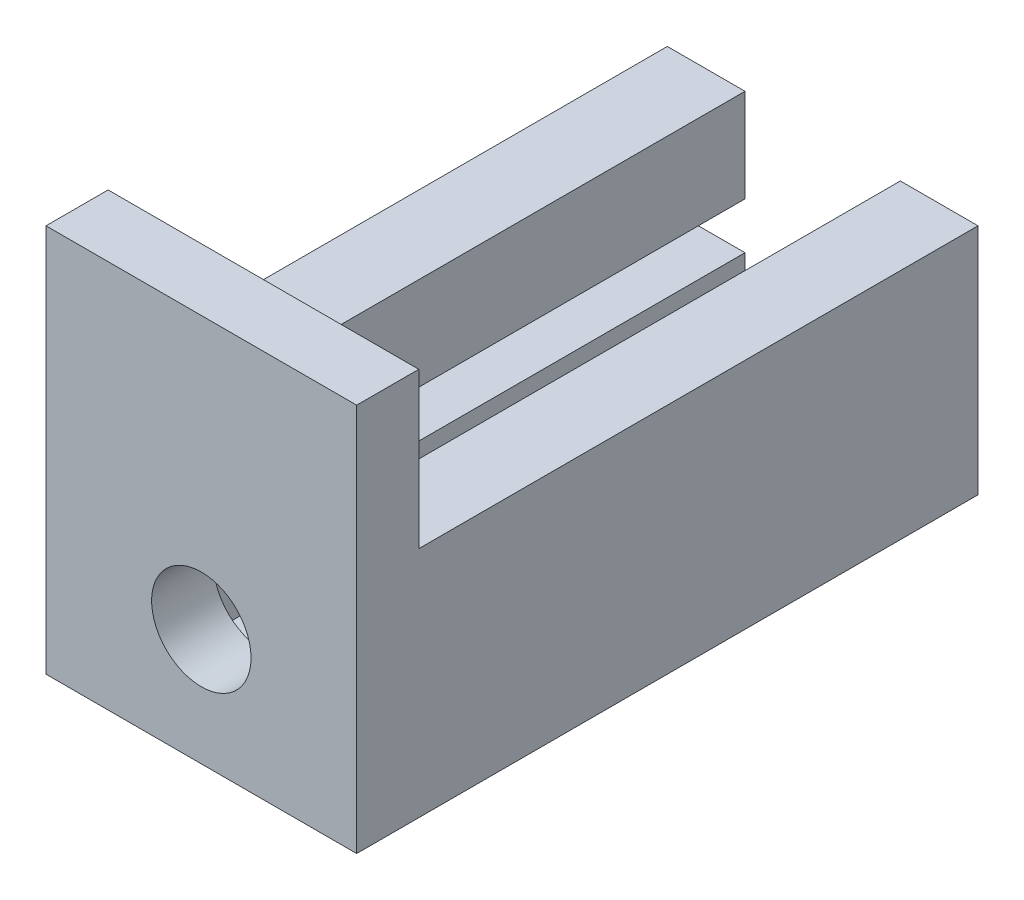
ISO-10303-21;
HEADER;
FILE_DESCRIPTION(('STEP AP214'),'2;1');
FILE_NAME('part.step','',(''),(''),'','','');
FILE_SCHEMA(('AUTOMOTIVE_DESIGN { 1 0 10303 214 1 1 1 1 }'));
ENDSEC;
DATA;
#1=APPLICATION_CONTEXT('core data for automotive mechanical design processes');
#2=APPLICATION_PROTOCOL_DEFINITION('international standard','automotive_design',2000,#1);
#3=PRODUCT_CONTEXT('',#1,'mechanical');
#4=PRODUCT('Part','Part','',(#3));
#5=PRODUCT_RELATED_PRODUCT_CATEGORY('part','',(#4));
#6=PRODUCT_DEFINITION_FORMATION('','',#4);
#7=PRODUCT_DEFINITION_CONTEXT('part definition',#1,'design');
#8=PRODUCT_DEFINITION('design','',#6,#7);
#9=PRODUCT_DEFINITION_SHAPE('','',#8);
#10=(LENGTH_UNIT() NAMED_UNIT(*) SI_UNIT(.MILLI.,.METRE.));
#11=(NAMED_UNIT(*) PLANE_ANGLE_UNIT() SI_UNIT($,.RADIAN.));
#12=(NAMED_UNIT(*) SI_UNIT($,.STERADIAN.) SOLID_ANGLE_UNIT());
#13=UNCERTAINTY_MEASURE_WITH_UNIT(LENGTH_MEASURE(1.E-05),#10,'distance_accuracy_value','');
#14=(GEOMETRIC_REPRESENTATION_CONTEXT(3) GLOBAL_UNCERTAINTY_ASSIGNED_CONTEXT((#13)) GLOBAL_UNIT_ASSIGNED_CONTEXT((#10,
#11,#12)) REPRESENTATION_CONTEXT('',''));
#15=CARTESIAN_POINT('',(0.,0.,0.));
#16=DIRECTION('',(0.,0.,1.));
#17=DIRECTION('',(1.,0.,0.));
#18=AXIS2_PLACEMENT_3D('',#15,#16,#17);
#19=CARTESIAN_POINT('',(-5.,15.,36.));
#20=DIRECTION('',(0.,-1.,0.));
#21=DIRECTION('',(1.,0.,0.));
#22=AXIS2_PLACEMENT_3D('',#19,#20,#21);
#23=PLANE('',#22);
#24=DIRECTION('',(-1.,0.,0.));
#25=VECTOR('',#24,1.);
#26=CARTESIAN_POINT('',(-5.,15.,36.));
#27=LINE('',#26,#25);
#28=CARTESIAN_POINT('',(15.,14.9999999999999,36.));
#29=VERTEX_POINT('',#28);
#30=CARTESIAN_POINT('',(10.,14.9999999999999,36.));
#31=VERTEX_POINT('',#30);
#32=EDGE_CURVE('E47',#29,#31,#27,.T.);
#33=ORIENTED_EDGE('',*,*,#32,.F.);
#34=DIRECTION('',(0.,0.,-1.));
#35=VECTOR('',#34,1.);
#36=CARTESIAN_POINT('',(15.,14.9999999999999,36.));
#37=LINE('',#36,#35);
#38=CARTESIAN_POINT('',(15.,14.9999999999999,0.));
#39=VERTEX_POINT('',#38);
#40=EDGE_CURVE('E248',#29,#39,#37,.T.);
#41=ORIENTED_EDGE('',*,*,#40,.T.);
#42=DIRECTION('',(-1.,0.,0.));
#43=VECTOR('',#42,1.);
#44=CARTESIAN_POINT('',(15.,14.9999999999999,0.));
#45=LINE('',#44,#43);
#46=CARTESIAN_POINT('',(10.,14.9999999999999,0.));
#47=VERTEX_POINT('',#46);
#48=EDGE_CURVE('E190',#39,#47,#45,.T.);
#49=ORIENTED_EDGE('',*,*,#48,.T.);
#50=DIRECTION('',(0.,0.,-1.));
#51=VECTOR('',#50,1.);
#52=CARTESIAN_POINT('',(10.,14.9999999999999,36.));
#53=LINE('',#52,#51);
#54=EDGE_CURVE('E123',#31,#47,#53,.T.);
#55=ORIENTED_EDGE('',*,*,#54,.F.);
#56=EDGE_LOOP('',(#33,#41,#49,#55));
#57=FACE_BOUND('',#56,.T.);
#58=ADVANCED_FACE('F37',(#57),#23,.F.);
#59=CARTESIAN_POINT('',(0.,15.,36.));
#60=VERTEX_POINT('',#59);
#61=CARTESIAN_POINT('',(-5.,15.,36.));
#62=VERTEX_POINT('',#61);
#63=EDGE_CURVE('E11',#60,#62,#27,.T.);
#64=ORIENTED_EDGE('',*,*,#63,.F.);
#65=DIRECTION('',(0.,0.,-1.));
#66=VECTOR('',#65,1.);
#67=CARTESIAN_POINT('',(0.,14.9999999999999,36.));
#68=LINE('',#67,#66);
#69=CARTESIAN_POINT('',(0.,14.9999999999999,0.));
#70=VERTEX_POINT('',#69);
#71=EDGE_CURVE('E224',#60,#70,#68,.T.);
#72=ORIENTED_EDGE('',*,*,#71,.T.);
#73=DIRECTION('',(-1.,0.,0.));
#74=VECTOR('',#73,1.);
#75=CARTESIAN_POINT('',(-5.,15.,0.));
#76=LINE('',#75,#74);
#77=CARTESIAN_POINT('',(-5.,15.,0.));
#78=VERTEX_POINT('',#77);
#79=EDGE_CURVE('E214',#70,#78,#76,.T.);
#80=ORIENTED_EDGE('',*,*,#79,.T.);
#81=DIRECTION('',(0.,0.,-1.));
#82=VECTOR('',#81,1.);
#83=CARTESIAN_POINT('',(-5.,15.,36.));
#84=LINE('',#83,#82);
#85=EDGE_CURVE('E222',#62,#78,#84,.T.);
#86=ORIENTED_EDGE('',*,*,#85,.F.);
#87=EDGE_LOOP('',(#64,#72,#80,#86));
#88=FACE_BOUND('',#87,.T.);
#89=ADVANCED_FACE('F329',(#88),#23,.F.);
#90=CARTESIAN_POINT('',(15.,0.,36.));
#91=DIRECTION('',(-1.,0.,0.));
#92=DIRECTION('',(0.,0.,1.));
#93=AXIS2_PLACEMENT_3D('',#90,#91,#92);
#94=PLANE('',#93);
#95=DIRECTION('',(0.,1.,0.));
#96=VECTOR('',#95,1.);
#97=CARTESIAN_POINT('',(15.,0.,0.));
#98=LINE('',#97,#96);
#99=CARTESIAN_POINT('',(15.,0.,0.));
#100=VERTEX_POINT('',#99);
#101=EDGE_CURVE('E187',#100,#39,#98,.T.);
#102=ORIENTED_EDGE('',*,*,#101,.T.);
#103=ORIENTED_EDGE('',*,*,#40,.F.);
#104=DIRECTION('',(0.,-1.,0.));
#105=VECTOR('',#104,1.);
#106=CARTESIAN_POINT('',(15.0000000000001,24.9999999999998,36.));
#107=LINE('',#106,#105);
#108=CARTESIAN_POINT('',(15.0000000000001,24.9999999999998,36.));
#109=VERTEX_POINT('',#108);
#110=EDGE_CURVE('E276',#109,#29,#107,.T.);
#111=ORIENTED_EDGE('',*,*,#110,.F.);
#112=DIRECTION('',(0.,0.,-1.));
#113=VECTOR('',#112,1.);
#114=CARTESIAN_POINT('',(15.0000000000001,24.9999999999998,36.));
#115=LINE('',#114,#113);
#116=CARTESIAN_POINT('',(15.0000000000001,24.9999999999998,40.));
#117=VERTEX_POINT('',#116);
#118=EDGE_CURVE('E352',#117,#109,#115,.T.);
#119=ORIENTED_EDGE('',*,*,#118,.F.);
#120=DIRECTION('',(0.,1.,0.));
#121=VECTOR('',#120,1.);
#122=CARTESIAN_POINT('',(15.,15.,40.));
#123=LINE('',#122,#121);
#124=CARTESIAN_POINT('',(15.,0.,40.));
#125=VERTEX_POINT('',#124);
#126=EDGE_CURVE('E191',#125,#117,#123,.T.);
#127=ORIENTED_EDGE('',*,*,#126,.F.);
#128=DIRECTION('',(0.,0.,-1.));
#129=VECTOR('',#128,1.);
#130=CARTESIAN_POINT('',(15.,0.,36.));
#131=LINE('',#130,#129);
#132=EDGE_CURVE('E41',#125,#100,#131,.T.);
#133=ORIENTED_EDGE('',*,*,#132,.T.);
#134=EDGE_LOOP('',(#102,#103,#111,#119,#127,#133));
#135=FACE_BOUND('',#134,.T.);
#136=ADVANCED_FACE('F39',(#135),#94,.F.);
#137=CARTESIAN_POINT('',(10.,14.9999999999999,36.));
#138=DIRECTION('',(1.,0.,0.));
#139=DIRECTION('',(0.,0.,-1.));
#140=AXIS2_PLACEMENT_3D('',#137,#138,#139);
#141=PLANE('',#140);
#142=DIRECTION('',(0.,-1.,0.));
#143=VECTOR('',#142,1.);
#144=CARTESIAN_POINT('',(10.,14.9999999999999,0.));
#145=LINE('',#144,#143);
#146=CARTESIAN_POINT('',(10.,8.99999999999992,0.));
#147=VERTEX_POINT('',#146);
#148=EDGE_CURVE('E193',#47,#147,#145,.T.);
#149=ORIENTED_EDGE('',*,*,#148,.T.);
#150=DIRECTION('',(0.,0.,-1.));
#151=VECTOR('',#150,1.);
#152=CARTESIAN_POINT('',(10.,8.99999999999992,36.));
#153=LINE('',#152,#151);
#154=CARTESIAN_POINT('',(10.,8.99999999999992,36.));
#155=VERTEX_POINT('',#154);
#156=EDGE_CURVE('E245',#155,#147,#153,.T.);
#157=ORIENTED_EDGE('',*,*,#156,.F.);
#158=DIRECTION('',(0.,-1.,0.));
#159=VECTOR('',#158,1.);
#160=CARTESIAN_POINT('',(10.,14.9999999999999,36.));
#161=LINE('',#160,#159);
#162=EDGE_CURVE('E220',#31,#155,#161,.T.);
#163=ORIENTED_EDGE('',*,*,#162,.F.);
#164=ORIENTED_EDGE('',*,*,#54,.T.);
#165=EDGE_LOOP('',(#149,#157,#163,#164));
#166=FACE_BOUND('',#165,.T.);
#167=ADVANCED_FACE('F267',(#166),#141,.F.);
#168=CARTESIAN_POINT('',(10.,8.99999999999992,36.));
#169=DIRECTION('',(0.,1.,0.));
#170=DIRECTION('',(0.,0.,1.));
#171=AXIS2_PLACEMENT_3D('',#168,#169,#170);
#172=PLANE('',#171);
#173=DIRECTION('',(1.,0.,0.));
#174=VECTOR('',#173,1.);
#175=CARTESIAN_POINT('',(10.,8.99999999999992,0.));
#176=LINE('',#175,#174);
#177=CARTESIAN_POINT('',(13.,8.99999999999992,0.));
#178=VERTEX_POINT('',#177);
#179=EDGE_CURVE('E195',#147,#178,#176,.T.);
#180=ORIENTED_EDGE('',*,*,#179,.T.);
#181=DIRECTION('',(0.,0.,-1.));
#182=VECTOR('',#181,1.);
#183=CARTESIAN_POINT('',(13.,8.99999999999992,36.));
#184=LINE('',#183,#182);
#185=CARTESIAN_POINT('',(13.,8.99999999999992,36.));
#186=VERTEX_POINT('',#185);
#187=EDGE_CURVE('E242',#186,#178,#184,.T.);
#188=ORIENTED_EDGE('',*,*,#187,.F.);
#189=DIRECTION('',(1.,0.,0.));
#190=VECTOR('',#189,1.);
#191=CARTESIAN_POINT('',(10.,8.99999999999992,36.));
#192=LINE('',#191,#190);
#193=EDGE_CURVE('E271',#155,#186,#192,.T.);
#194=ORIENTED_EDGE('',*,*,#193,.F.);
#195=ORIENTED_EDGE('',*,*,#156,.T.);
#196=EDGE_LOOP('',(#180,#188,#194,#195));
#197=FACE_BOUND('',#196,.T.);
#198=ADVANCED_FACE('F394',(#197),#172,.F.);
#199=CARTESIAN_POINT('',(13.,8.99999999999992,36.));
#200=DIRECTION('',(1.,0.,0.));
#201=DIRECTION('',(0.,0.,-1.));
#202=AXIS2_PLACEMENT_3D('',#199,#200,#201);
#203=PLANE('',#202);
#204=DIRECTION('',(0.,-1.,0.));
#205=VECTOR('',#204,1.);
#206=CARTESIAN_POINT('',(13.,8.99999999999992,0.));
#207=LINE('',#206,#205);
#208=CARTESIAN_POINT('',(13.,5.99999999999992,0.));
#209=VERTEX_POINT('',#208);
#210=EDGE_CURVE('E197',#178,#209,#207,.T.);
#211=ORIENTED_EDGE('',*,*,#210,.T.);
#212=DIRECTION('',(0.,0.,-1.));
#213=VECTOR('',#212,1.);
#214=CARTESIAN_POINT('',(13.,5.99999999999992,36.));
#215=LINE('',#214,#213);
#216=CARTESIAN_POINT('',(13.,5.99999999999992,36.));
#217=VERTEX_POINT('',#216);
#218=EDGE_CURVE('E239',#217,#209,#215,.T.);
#219=ORIENTED_EDGE('',*,*,#218,.F.);
#220=DIRECTION('',(0.,-1.,0.));
#221=VECTOR('',#220,1.);
#222=CARTESIAN_POINT('',(13.,8.99999999999992,36.));
#223=LINE('',#222,#221);
#224=EDGE_CURVE('E302',#186,#217,#223,.T.);
#225=ORIENTED_EDGE('',*,*,#224,.F.);
#226=ORIENTED_EDGE('',*,*,#187,.T.);
#227=EDGE_LOOP('',(#211,#219,#225,#226));
#228=FACE_BOUND('',#227,.T.);
#229=ADVANCED_FACE('F390',(#228),#203,.F.);
#230=CARTESIAN_POINT('',(13.,5.99999999999992,36.));
#231=DIRECTION('',(0.,-1.,0.));
#232=DIRECTION('',(1.,0.,0.));
#233=AXIS2_PLACEMENT_3D('',#230,#231,#232);
#234=PLANE('',#233);
#235=DIRECTION('',(-1.,0.,0.));
#236=VECTOR('',#235,1.);
#237=CARTESIAN_POINT('',(13.,5.99999999999992,0.));
#238=LINE('',#237,#236);
#239=CARTESIAN_POINT('',(10.,5.99999999999992,0.));
#240=VERTEX_POINT('',#239);
#241=EDGE_CURVE('E199',#209,#240,#238,.T.);
#242=ORIENTED_EDGE('',*,*,#241,.T.);
#243=DIRECTION('',(0.,0.,-1.));
#244=VECTOR('',#243,1.);
#245=CARTESIAN_POINT('',(10.,5.99999999999992,36.));
#246=LINE('',#245,#244);
#247=CARTESIAN_POINT('',(10.,5.99999999999992,36.));
#248=VERTEX_POINT('',#247);
#249=EDGE_CURVE('E236',#248,#240,#246,.T.);
#250=ORIENTED_EDGE('',*,*,#249,.F.);
#251=DIRECTION('',(-1.,0.,0.));
#252=VECTOR('',#251,1.);
#253=CARTESIAN_POINT('',(13.,5.99999999999992,36.));
#254=LINE('',#253,#252);
#255=EDGE_CURVE('E305',#217,#248,#254,.T.);
#256=ORIENTED_EDGE('',*,*,#255,.F.);
#257=ORIENTED_EDGE('',*,*,#218,.T.);
#258=EDGE_LOOP('',(#242,#250,#256,#257));
#259=FACE_BOUND('',#258,.T.);
#260=ADVANCED_FACE('F386',(#259),#234,.F.);
#261=CARTESIAN_POINT('',(10.,5.99999999999992,36.));
#262=DIRECTION('',(1.,0.,0.));
#263=DIRECTION('',(0.,1.,0.));
#264=AXIS2_PLACEMENT_3D('',#261,#262,#263);
#265=PLANE('',#264);
#266=DIRECTION('',(0.,-1.,0.));
#267=VECTOR('',#266,1.);
#268=CARTESIAN_POINT('',(10.,5.99999999999992,0.));
#269=LINE('',#268,#267);
#270=CARTESIAN_POINT('',(10.,1.99999999999992,0.));
#271=VERTEX_POINT('',#270);
#272=EDGE_CURVE('E201',#240,#271,#269,.T.);
#273=ORIENTED_EDGE('',*,*,#272,.T.);
#274=DIRECTION('',(0.,0.,-1.));
#275=VECTOR('',#274,1.);
#276=CARTESIAN_POINT('',(10.,1.99999999999992,36.));
#277=LINE('',#276,#275);
#278=CARTESIAN_POINT('',(10.,1.99999999999992,36.));
#279=VERTEX_POINT('',#278);
#280=EDGE_CURVE('E233',#279,#271,#277,.T.);
#281=ORIENTED_EDGE('',*,*,#280,.F.);
#282=DIRECTION('',(0.,-1.,0.));
#283=VECTOR('',#282,1.);
#284=CARTESIAN_POINT('',(10.,5.99999999999992,36.));
#285=LINE('',#284,#283);
#286=EDGE_CURVE('E308',#248,#279,#285,.T.);
#287=ORIENTED_EDGE('',*,*,#286,.F.);
#288=ORIENTED_EDGE('',*,*,#249,.T.);
#289=EDGE_LOOP('',(#273,#281,#287,#288));
#290=FACE_BOUND('',#289,.T.);
#291=ADVANCED_FACE('F383',(#290),#265,.F.);
#292=CARTESIAN_POINT('',(10.,1.99999999999992,36.));
#293=DIRECTION('',(0.,-1.,0.));
#294=DIRECTION('',(0.,0.,-1.));
#295=AXIS2_PLACEMENT_3D('',#292,#293,#294);
#296=PLANE('',#295);
#297=DIRECTION('',(-1.,0.,0.));
#298=VECTOR('',#297,1.);
#299=CARTESIAN_POINT('',(10.,1.99999999999992,0.));
#300=LINE('',#299,#298);
#301=CARTESIAN_POINT('',(0.,1.99999999999992,0.));
#302=VERTEX_POINT('',#301);
#303=EDGE_CURVE('E203',#271,#302,#300,.T.);
#304=ORIENTED_EDGE('',*,*,#303,.T.);
#305=DIRECTION('',(0.,0.,-1.));
#306=VECTOR('',#305,1.);
#307=CARTESIAN_POINT('',(0.,1.99999999999992,36.));
#308=LINE('',#307,#306);
#309=CARTESIAN_POINT('',(0.,1.99999999999992,36.));
#310=VERTEX_POINT('',#309);
#311=EDGE_CURVE('E230',#310,#302,#308,.T.);
#312=ORIENTED_EDGE('',*,*,#311,.F.);
#313=DIRECTION('',(-1.,0.,0.));
#314=VECTOR('',#313,1.);
#315=CARTESIAN_POINT('',(10.,1.99999999999992,36.));
#316=LINE('',#315,#314);
#317=EDGE_CURVE('E179',#279,#310,#316,.T.);
#318=ORIENTED_EDGE('',*,*,#317,.F.);
#319=ORIENTED_EDGE('',*,*,#280,.T.);
#320=EDGE_LOOP('',(#304,#312,#318,#319));
#321=FACE_BOUND('',#320,.T.);
#322=ADVANCED_FACE('F313',(#321),#296,.F.);
#323=CARTESIAN_POINT('',(0.,1.99999999999992,36.));
#324=DIRECTION('',(-1.,0.,0.));
#325=DIRECTION('',(0.,-1.,0.));
#326=AXIS2_PLACEMENT_3D('',#323,#324,#325);
#327=PLANE('',#326);
#328=DIRECTION('',(0.,1.,0.));
#329=VECTOR('',#328,1.);
#330=CARTESIAN_POINT('',(0.,1.99999999999992,0.));
#331=LINE('',#330,#329);
#332=CARTESIAN_POINT('',(0.,6.,0.));
#333=VERTEX_POINT('',#332);
#334=EDGE_CURVE('E205',#302,#333,#331,.T.);
#335=ORIENTED_EDGE('',*,*,#334,.T.);
#336=DIRECTION('',(0.,0.,-1.));
#337=VECTOR('',#336,1.);
#338=CARTESIAN_POINT('',(0.,6.,36.));
#339=LINE('',#338,#337);
#340=CARTESIAN_POINT('',(0.,6.,36.));
#341=VERTEX_POINT('',#340);
#342=EDGE_CURVE('E162',#341,#333,#339,.T.);
#343=ORIENTED_EDGE('',*,*,#342,.F.);
#344=DIRECTION('',(0.,1.,0.));
#345=VECTOR('',#344,1.);
#346=CARTESIAN_POINT('',(0.,1.99999999999992,36.));
#347=LINE('',#346,#345);
#348=EDGE_CURVE('E177',#310,#341,#347,.T.);
#349=ORIENTED_EDGE('',*,*,#348,.F.);
#350=ORIENTED_EDGE('',*,*,#311,.T.);
#351=EDGE_LOOP('',(#335,#343,#349,#350));
#352=FACE_BOUND('',#351,.T.);
#353=ADVANCED_FACE('F317',(#352),#327,.F.);
#354=CARTESIAN_POINT('',(-3.,6.,36.));
#355=DIRECTION('',(0.,-1.,0.));
#356=DIRECTION('',(0.,0.,-1.));
#357=AXIS2_PLACEMENT_3D('',#354,#355,#356);
#358=PLANE('',#357);
#359=DIRECTION('',(-1.,0.,0.));
#360=VECTOR('',#359,1.);
#361=CARTESIAN_POINT('',(-3.,6.,0.));
#362=LINE('',#361,#360);
#363=CARTESIAN_POINT('',(-3.,6.,0.));
#364=VERTEX_POINT('',#363);
#365=EDGE_CURVE('E159',#333,#364,#362,.T.);
#366=ORIENTED_EDGE('',*,*,#365,.T.);
#367=DIRECTION('',(0.,0.,-1.));
#368=VECTOR('',#367,1.);
#369=CARTESIAN_POINT('',(-3.,6.,36.));
#370=LINE('',#369,#368);
#371=CARTESIAN_POINT('',(-3.,6.,36.));
#372=VERTEX_POINT('',#371);
#373=EDGE_CURVE('E151',#372,#364,#370,.T.);
#374=ORIENTED_EDGE('',*,*,#373,.F.);
#375=DIRECTION('',(-1.,0.,0.));
#376=VECTOR('',#375,1.);
#377=CARTESIAN_POINT('',(-3.,6.,36.));
#378=LINE('',#377,#376);
#379=EDGE_CURVE('E156',#341,#372,#378,.T.);
#380=ORIENTED_EDGE('',*,*,#379,.F.);
#381=ORIENTED_EDGE('',*,*,#342,.T.);
#382=EDGE_LOOP('',(#366,#374,#380,#381));
#383=FACE_BOUND('',#382,.T.);
#384=ADVANCED_FACE('F153',(#383),#358,.F.);
#385=CARTESIAN_POINT('',(-3.,8.99999999999996,36.));
#386=DIRECTION('',(-1.,0.,0.));
#387=DIRECTION('',(0.,0.,1.));
#388=AXIS2_PLACEMENT_3D('',#385,#386,#387);
#389=PLANE('',#388);
#390=DIRECTION('',(0.,1.,0.));
#391=VECTOR('',#390,1.);
#392=CARTESIAN_POINT('',(-3.,8.99999999999996,0.));
#393=LINE('',#392,#391);
#394=CARTESIAN_POINT('',(-3.,8.99999999999996,0.));
#395=VERTEX_POINT('',#394);
#396=EDGE_CURVE('E208',#364,#395,#393,.T.);
#397=ORIENTED_EDGE('',*,*,#396,.T.);
#398=DIRECTION('',(0.,0.,-1.));
#399=VECTOR('',#398,1.);
#400=CARTESIAN_POINT('',(-3.,8.99999999999996,36.));
#401=LINE('',#400,#399);
#402=CARTESIAN_POINT('',(-3.,8.99999999999996,36.));
#403=VERTEX_POINT('',#402);
#404=EDGE_CURVE('E163',#403,#395,#401,.T.);
#405=ORIENTED_EDGE('',*,*,#404,.F.);
#406=DIRECTION('',(0.,1.,0.));
#407=VECTOR('',#406,1.);
#408=CARTESIAN_POINT('',(-3.,8.99999999999996,36.));
#409=LINE('',#408,#407);
#410=EDGE_CURVE('E166',#372,#403,#409,.T.);
#411=ORIENTED_EDGE('',*,*,#410,.F.);
#412=ORIENTED_EDGE('',*,*,#373,.T.);
#413=EDGE_LOOP('',(#397,#405,#411,#412));
#414=FACE_BOUND('',#413,.T.);
#415=ADVANCED_FACE('F167',(#414),#389,.F.);
#416=CARTESIAN_POINT('',(0.,8.99999999999996,36.));
#417=DIRECTION('',(0.,1.,0.));
#418=DIRECTION('',(-1.,0.,0.));
#419=AXIS2_PLACEMENT_3D('',#416,#417,#418);
#420=PLANE('',#419);
#421=DIRECTION('',(1.,0.,0.));
#422=VECTOR('',#421,1.);
#423=CARTESIAN_POINT('',(0.,8.99999999999996,0.));
#424=LINE('',#423,#422);
#425=CARTESIAN_POINT('',(0.,8.99999999999996,0.));
#426=VERTEX_POINT('',#425);
#427=EDGE_CURVE('E210',#395,#426,#424,.T.);
#428=ORIENTED_EDGE('',*,*,#427,.T.);
#429=DIRECTION('',(0.,0.,-1.));
#430=VECTOR('',#429,1.);
#431=CARTESIAN_POINT('',(0.,8.99999999999996,36.));
#432=LINE('',#431,#430);
#433=CARTESIAN_POINT('',(0.,8.99999999999996,36.));
#434=VERTEX_POINT('',#433);
#435=EDGE_CURVE('E62',#434,#426,#432,.T.);
#436=ORIENTED_EDGE('',*,*,#435,.F.);
#437=DIRECTION('',(1.,0.,0.));
#438=VECTOR('',#437,1.);
#439=CARTESIAN_POINT('',(0.,8.99999999999996,36.));
#440=LINE('',#439,#438);
#441=EDGE_CURVE('E171',#403,#434,#440,.T.);
#442=ORIENTED_EDGE('',*,*,#441,.F.);
#443=ORIENTED_EDGE('',*,*,#404,.T.);
#444=EDGE_LOOP('',(#428,#436,#442,#443));
#445=FACE_BOUND('',#444,.T.);
#446=ADVANCED_FACE('F320',(#445),#420,.F.);
#447=CARTESIAN_POINT('',(0.,14.9999999999999,36.));
#448=DIRECTION('',(-1.,0.,0.));
#449=DIRECTION('',(0.,-1.,0.));
#450=AXIS2_PLACEMENT_3D('',#447,#448,#449);
#451=PLANE('',#450);
#452=DIRECTION('',(0.,1.,0.));
#453=VECTOR('',#452,1.);
#454=CARTESIAN_POINT('',(0.,14.9999999999999,0.));
#455=LINE('',#454,#453);
#456=EDGE_CURVE('E212',#426,#70,#455,.T.);
#457=ORIENTED_EDGE('',*,*,#456,.T.);
#458=ORIENTED_EDGE('',*,*,#71,.F.);
#459=DIRECTION('',(0.,1.,0.));
#460=VECTOR('',#459,1.);
#461=CARTESIAN_POINT('',(0.,14.9999999999999,36.));
#462=LINE('',#461,#460);
#463=EDGE_CURVE('E184',#434,#60,#462,.T.);
#464=ORIENTED_EDGE('',*,*,#463,.F.);
#465=ORIENTED_EDGE('',*,*,#435,.T.);
#466=EDGE_LOOP('',(#457,#458,#464,#465));
#467=FACE_BOUND('',#466,.T.);
#468=ADVANCED_FACE('F326',(#467),#451,.F.);
#469=CARTESIAN_POINT('',(-5.,0.,36.));
#470=DIRECTION('',(1.,0.,0.));
#471=DIRECTION('',(0.,0.,-1.));
#472=AXIS2_PLACEMENT_3D('',#469,#470,#471);
#473=PLANE('',#472);
#474=DIRECTION('',(0.,-1.,0.));
#475=VECTOR('',#474,1.);
#476=CARTESIAN_POINT('',(-5.,0.,0.));
#477=LINE('',#476,#475);
#478=CARTESIAN_POINT('',(-5.,0.,0.));
#479=VERTEX_POINT('',#478);
#480=EDGE_CURVE('E118',#78,#479,#477,.T.);
#481=ORIENTED_EDGE('',*,*,#480,.T.);
#482=DIRECTION('',(0.,0.,-1.));
#483=VECTOR('',#482,1.);
#484=CARTESIAN_POINT('',(-5.,0.,36.));
#485=LINE('',#484,#483);
#486=CARTESIAN_POINT('',(-5.,0.,40.));
#487=VERTEX_POINT('',#486);
#488=EDGE_CURVE('E186',#487,#479,#485,.T.);
#489=ORIENTED_EDGE('',*,*,#488,.F.);
#490=DIRECTION('',(0.,-1.,0.));
#491=VECTOR('',#490,1.);
#492=CARTESIAN_POINT('',(-5.,15.,40.));
#493=LINE('',#492,#491);
#494=CARTESIAN_POINT('',(-4.99999999999991,25.,40.));
#495=VERTEX_POINT('',#494);
#496=EDGE_CURVE('E293',#495,#487,#493,.T.);
#497=ORIENTED_EDGE('',*,*,#496,.F.);
#498=DIRECTION('',(0.,0.,1.));
#499=VECTOR('',#498,1.);
#500=CARTESIAN_POINT('',(-4.99999999999991,25.,36.));
#501=LINE('',#500,#499);
#502=CARTESIAN_POINT('',(-4.99999999999991,25.,36.));
#503=VERTEX_POINT('',#502);
#504=EDGE_CURVE('E277',#503,#495,#501,.T.);
#505=ORIENTED_EDGE('',*,*,#504,.F.);
#506=DIRECTION('',(0.,-1.,0.));
#507=VECTOR('',#506,1.);
#508=CARTESIAN_POINT('',(-4.99999999999991,25.,36.));
#509=LINE('',#508,#507);
#510=EDGE_CURVE('E285',#503,#62,#509,.T.);
#511=ORIENTED_EDGE('',*,*,#510,.T.);
#512=ORIENTED_EDGE('',*,*,#85,.T.);
#513=EDGE_LOOP('',(#481,#489,#497,#505,#511,#512));
#514=FACE_BOUND('',#513,.T.);
#515=ADVANCED_FACE('F333',(#514),#473,.F.);
#516=CARTESIAN_POINT('',(0.,0.,36.));
#517=DIRECTION('',(0.,1.,0.));
#518=DIRECTION('',(-1.,0.,0.));
#519=AXIS2_PLACEMENT_3D('',#516,#517,#518);
#520=PLANE('',#519);
#521=DIRECTION('',(1.,0.,0.));
#522=VECTOR('',#521,1.);
#523=CARTESIAN_POINT('',(0.,0.,0.));
#524=LINE('',#523,#522);
#525=EDGE_CURVE('E218',#479,#100,#524,.T.);
#526=ORIENTED_EDGE('',*,*,#525,.T.);
#527=ORIENTED_EDGE('',*,*,#132,.F.);
#528=DIRECTION('',(1.,0.,0.));
#529=VECTOR('',#528,1.);
#530=CARTESIAN_POINT('',(-5.,0.,40.));
#531=LINE('',#530,#529);
#532=EDGE_CURVE('E298',#487,#125,#531,.T.);
#533=ORIENTED_EDGE('',*,*,#532,.F.);
#534=ORIENTED_EDGE('',*,*,#488,.T.);
#535=EDGE_LOOP('',(#526,#527,#533,#534));
#536=FACE_BOUND('',#535,.T.);
#537=ADVANCED_FACE('F428',(#536),#520,.F.);
#538=CARTESIAN_POINT('',(0.,0.,0.));
#539=DIRECTION('',(0.,0.,1.));
#540=DIRECTION('',(1.,0.,0.));
#541=AXIS2_PLACEMENT_3D('',#538,#539,#540);
#542=PLANE('',#541);
#543=ORIENTED_EDGE('',*,*,#101,.F.);
#544=ORIENTED_EDGE('',*,*,#525,.F.);
#545=ORIENTED_EDGE('',*,*,#480,.F.);
#546=ORIENTED_EDGE('',*,*,#79,.F.);
#547=ORIENTED_EDGE('',*,*,#456,.F.);
#548=ORIENTED_EDGE('',*,*,#427,.F.);
#549=ORIENTED_EDGE('',*,*,#396,.F.);
#550=ORIENTED_EDGE('',*,*,#365,.F.);
#551=ORIENTED_EDGE('',*,*,#334,.F.);
#552=ORIENTED_EDGE('',*,*,#303,.F.);
#553=ORIENTED_EDGE('',*,*,#272,.F.);
#554=ORIENTED_EDGE('',*,*,#241,.F.);
#555=ORIENTED_EDGE('',*,*,#210,.F.);
#556=ORIENTED_EDGE('',*,*,#179,.F.);
#557=ORIENTED_EDGE('',*,*,#148,.F.);
#558=ORIENTED_EDGE('',*,*,#48,.F.);
#559=EDGE_LOOP('',(#543,#544,#545,#546,#547,#548,#549,#550,#551,#552,#553,#554,#555,#556,#557,#558));
#560=FACE_BOUND('',#559,.T.);
#561=ADVANCED_FACE('F263',(#560),#542,.F.);
#562=CARTESIAN_POINT('',(0.,0.,36.));
#563=DIRECTION('',(0.,0.,1.));
#564=DIRECTION('',(1.,0.,0.));
#565=AXIS2_PLACEMENT_3D('',#562,#563,#564);
#566=PLANE('',#565);
#567=CARTESIAN_POINT('',(5.,7.49999999999998,36.));
#568=DIRECTION('',(0.,0.,1.));
#569=DIRECTION('',(1.,0.,0.));
#570=AXIS2_PLACEMENT_3D('',#567,#568,#569);
#571=CIRCLE('',#570,3.2);
#572=CARTESIAN_POINT('',(8.2,7.49999999999998,36.));
#573=VERTEX_POINT('',#572);
#574=EDGE_CURVE('E290',#573,#573,#571,.T.);
#575=ORIENTED_EDGE('',*,*,#574,.T.);
#576=EDGE_LOOP('',(#575));
#577=FACE_BOUND('',#576,.T.);
#578=ORIENTED_EDGE('',*,*,#463,.T.);
#579=ORIENTED_EDGE('',*,*,#63,.T.);
#580=ORIENTED_EDGE('',*,*,#510,.F.);
#581=DIRECTION('',(-1.,0.,0.));
#582=VECTOR('',#581,1.);
#583=CARTESIAN_POINT('',(-4.99999999999991,25.,36.));
#584=LINE('',#583,#582);
#585=EDGE_CURVE('E283',#109,#503,#584,.T.);
#586=ORIENTED_EDGE('',*,*,#585,.F.);
#587=ORIENTED_EDGE('',*,*,#110,.T.);
#588=ORIENTED_EDGE('',*,*,#32,.T.);
#589=ORIENTED_EDGE('',*,*,#162,.T.);
#590=ORIENTED_EDGE('',*,*,#193,.T.);
#591=ORIENTED_EDGE('',*,*,#224,.T.);
#592=ORIENTED_EDGE('',*,*,#255,.T.);
#593=ORIENTED_EDGE('',*,*,#286,.T.);
#594=ORIENTED_EDGE('',*,*,#317,.T.);
#595=ORIENTED_EDGE('',*,*,#348,.T.);
#596=ORIENTED_EDGE('',*,*,#379,.T.);
#597=ORIENTED_EDGE('',*,*,#410,.T.);
#598=ORIENTED_EDGE('',*,*,#441,.T.);
#599=EDGE_LOOP('',(#578,#579,#580,#586,#587,#588,#589,#590,#591,#592,#593,#594,#595,#596,#597,#598));
#600=FACE_BOUND('',#599,.T.);
#601=ADVANCED_FACE('F174',(#577,#600),#566,.F.);
#602=CARTESIAN_POINT('',(0.,0.,40.));
#603=DIRECTION('',(0.,0.,1.));
#604=DIRECTION('',(1.,0.,0.));
#605=AXIS2_PLACEMENT_3D('',#602,#603,#604);
#606=PLANE('',#605);
#607=CARTESIAN_POINT('',(5.,7.49999999999998,40.));
#608=DIRECTION('',(0.,0.,1.));
#609=DIRECTION('',(1.,0.,0.));
#610=AXIS2_PLACEMENT_3D('',#607,#608,#609);
#611=CIRCLE('',#610,3.2);
#612=CARTESIAN_POINT('',(8.2,7.49999999999998,40.));
#613=VERTEX_POINT('',#612);
#614=EDGE_CURVE('E289',#613,#613,#611,.T.);
#615=ORIENTED_EDGE('',*,*,#614,.F.);
#616=EDGE_LOOP('',(#615));
#617=FACE_BOUND('',#616,.T.);
#618=ORIENTED_EDGE('',*,*,#496,.T.);
#619=ORIENTED_EDGE('',*,*,#532,.T.);
#620=ORIENTED_EDGE('',*,*,#126,.T.);
#621=DIRECTION('',(1.,0.,0.));
#622=VECTOR('',#621,1.);
#623=CARTESIAN_POINT('',(-4.99999999999991,25.,40.));
#624=LINE('',#623,#622);
#625=EDGE_CURVE('E279',#495,#117,#624,.T.);
#626=ORIENTED_EDGE('',*,*,#625,.F.);
#627=EDGE_LOOP('',(#618,#619,#620,#626));
#628=FACE_BOUND('',#627,.T.);
#629=ADVANCED_FACE('F351',(#617,#628),#606,.T.);
#630=CARTESIAN_POINT('',(5.,7.49999999999998,36.));
#631=DIRECTION('',(0.,0.,1.));
#632=DIRECTION('',(1.,0.,0.));
#633=AXIS2_PLACEMENT_3D('',#630,#631,#632);
#634=CYLINDRICAL_SURFACE('',#633,3.2);
#635=ORIENTED_EDGE('',*,*,#574,.F.);
#636=EDGE_LOOP('',(#635));
#637=FACE_BOUND('',#636,.T.);
#638=ORIENTED_EDGE('',*,*,#614,.T.);
#639=EDGE_LOOP('',(#638));
#640=FACE_BOUND('',#639,.T.);
#641=ADVANCED_FACE('F356',(#637,#640),#634,.F.);
#642=CARTESIAN_POINT('',(2.25514051876984E-13,24.9999999999999,0.));
#643=DIRECTION('',(0.,1.,0.));
#644=DIRECTION('',(-1.,0.,0.));
#645=AXIS2_PLACEMENT_3D('',#642,#643,#644);
#646=PLANE('',#645);
#647=ORIENTED_EDGE('',*,*,#504,.T.);
#648=ORIENTED_EDGE('',*,*,#625,.T.);
#649=ORIENTED_EDGE('',*,*,#118,.T.);
#650=ORIENTED_EDGE('',*,*,#585,.T.);
#651=EDGE_LOOP('',(#647,#648,#649,#650));
#652=FACE_BOUND('',#651,.T.);
#653=ADVANCED_FACE('F354',(#652),#646,.T.);
#654=CLOSED_SHELL('',(#58,#89,#136,#167,#198,#229,#260,#291,#322,#353,#384,#415,#446,#468,#515,
#537,#561,#601,#629,#641,#653));
#655=MANIFOLD_SOLID_BREP('B2',#654);
#656=ADVANCED_BREP_SHAPE_REPRESENTATION('',(#18,#655),#14);
#657=SHAPE_DEFINITION_REPRESENTATION(#9,#656);
ENDSEC;
END-ISO-10303-21;
